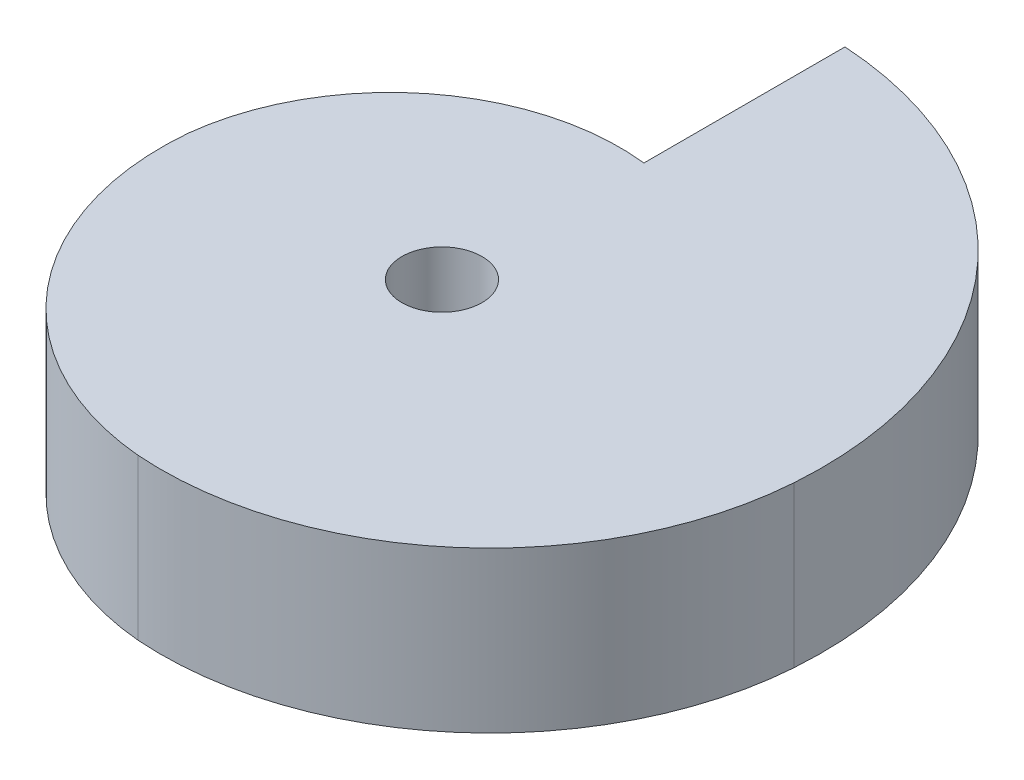
ISO-10303-21;
HEADER;
FILE_DESCRIPTION(('STEP AP214'),'2;1');
FILE_NAME('part.step','',(''),(''),'','','');
FILE_SCHEMA(('AUTOMOTIVE_DESIGN { 1 0 10303 214 1 1 1 1 }'));
ENDSEC;
DATA;
#1=APPLICATION_CONTEXT('core data for automotive mechanical design processes');
#2=APPLICATION_PROTOCOL_DEFINITION('international standard','automotive_design',2000,#1);
#3=PRODUCT_CONTEXT('',#1,'mechanical');
#4=PRODUCT('Part','Part','',(#3));
#5=PRODUCT_RELATED_PRODUCT_CATEGORY('part','',(#4));
#6=PRODUCT_DEFINITION_FORMATION('','',#4);
#7=PRODUCT_DEFINITION_CONTEXT('part definition',#1,'design');
#8=PRODUCT_DEFINITION('design','',#6,#7);
#9=PRODUCT_DEFINITION_SHAPE('','',#8);
#10=(LENGTH_UNIT() NAMED_UNIT(*) SI_UNIT(.MILLI.,.METRE.));
#11=(NAMED_UNIT(*) PLANE_ANGLE_UNIT() SI_UNIT($,.RADIAN.));
#12=(NAMED_UNIT(*) SI_UNIT($,.STERADIAN.) SOLID_ANGLE_UNIT());
#13=UNCERTAINTY_MEASURE_WITH_UNIT(LENGTH_MEASURE(1.E-05),#10,'distance_accuracy_value','');
#14=(GEOMETRIC_REPRESENTATION_CONTEXT(3) GLOBAL_UNCERTAINTY_ASSIGNED_CONTEXT((#13)) GLOBAL_UNIT_ASSIGNED_CONTEXT((#10,
#11,#12)) REPRESENTATION_CONTEXT('',''));
#15=CARTESIAN_POINT('',(0.,0.,0.));
#16=DIRECTION('',(0.,0.,1.));
#17=DIRECTION('',(1.,0.,0.));
#18=AXIS2_PLACEMENT_3D('',#15,#16,#17);
#19=CARTESIAN_POINT('',(0.758997716997192,5.08,-0.758997716997387));
#20=DIRECTION('',(0.,-1.,0.));
#21=DIRECTION('',(0.,0.,-1.));
#22=AXIS2_PLACEMENT_3D('',#19,#20,#21);
#23=CYLINDRICAL_SURFACE('',#22,10.4303428605781);
#24=CARTESIAN_POINT('',(0.758997716997192,0.,-0.758997716997387));
#25=DIRECTION('',(0.,1.,0.));
#26=DIRECTION('',(0.,0.,1.));
#27=AXIS2_PLACEMENT_3D('',#24,#25,#26);
#28=CIRCLE('',#27,10.4303428605781);
#29=CARTESIAN_POINT('',(0.,0.,9.64369302409479));
#30=VERTEX_POINT('',#29);
#31=CARTESIAN_POINT('',(11.1616884580894,0.,0.));
#32=VERTEX_POINT('',#31);
#33=EDGE_CURVE('E127',#30,#32,#28,.T.);
#34=ORIENTED_EDGE('',*,*,#33,.T.);
#35=DIRECTION('',(0.,-1.,0.));
#36=VECTOR('',#35,1.);
#37=CARTESIAN_POINT('',(11.1616884580894,5.08,0.));
#38=LINE('',#37,#36);
#39=CARTESIAN_POINT('',(11.1616884580894,5.08,0.));
#40=VERTEX_POINT('',#39);
#41=EDGE_CURVE('E11',#40,#32,#38,.T.);
#42=ORIENTED_EDGE('',*,*,#41,.F.);
#43=CARTESIAN_POINT('',(0.758997716997192,5.08,-0.758997716997387));
#44=DIRECTION('',(0.,1.,0.));
#45=DIRECTION('',(0.,0.,1.));
#46=AXIS2_PLACEMENT_3D('',#43,#44,#45);
#47=CIRCLE('',#46,10.4303428605781);
#48=CARTESIAN_POINT('',(0.,5.08,9.64369302409479));
#49=VERTEX_POINT('',#48);
#50=EDGE_CURVE('E116',#49,#40,#47,.T.);
#51=ORIENTED_EDGE('',*,*,#50,.F.);
#52=DIRECTION('',(0.,-1.,0.));
#53=VECTOR('',#52,1.);
#54=CARTESIAN_POINT('',(0.,5.08,9.64369302409479));
#55=LINE('',#54,#53);
#56=EDGE_CURVE('E122',#49,#30,#55,.T.);
#57=ORIENTED_EDGE('',*,*,#56,.T.);
#58=EDGE_LOOP('',(#34,#42,#51,#57));
#59=FACE_BOUND('',#58,.T.);
#60=ADVANCED_FACE('F41',(#59),#23,.T.);
#61=CARTESIAN_POINT('',(-0.742561583801506,5.08,-0.868553995234179));
#62=DIRECTION('',(0.,-1.,0.));
#63=DIRECTION('',(0.,0.,-1.));
#64=AXIS2_PLACEMENT_3D('',#61,#62,#63);
#65=CYLINDRICAL_SURFACE('',#64,11.9358935611246);
#66=CARTESIAN_POINT('',(-0.742561583801506,0.,-0.868553995234179));
#67=DIRECTION('',(0.,1.,0.));
#68=DIRECTION('',(0.,0.,1.));
#69=AXIS2_PLACEMENT_3D('',#66,#67,#68);
#70=CIRCLE('',#69,11.9358935611246);
#71=CARTESIAN_POINT('',(0.,0.,-12.7813268629068));
#72=VERTEX_POINT('',#71);
#73=EDGE_CURVE('E131',#32,#72,#70,.T.);
#74=ORIENTED_EDGE('',*,*,#73,.T.);
#75=DIRECTION('',(0.,-1.,0.));
#76=VECTOR('',#75,1.);
#77=CARTESIAN_POINT('',(0.,5.08,-12.7813268629068));
#78=LINE('',#77,#76);
#79=CARTESIAN_POINT('',(0.,5.08,-12.7813268629068));
#80=VERTEX_POINT('',#79);
#81=EDGE_CURVE('E51',#80,#72,#78,.T.);
#82=ORIENTED_EDGE('',*,*,#81,.F.);
#83=CARTESIAN_POINT('',(-0.742561583801506,5.08,-0.868553995234179));
#84=DIRECTION('',(0.,1.,0.));
#85=DIRECTION('',(0.,0.,1.));
#86=AXIS2_PLACEMENT_3D('',#83,#84,#85);
#87=CIRCLE('',#86,11.9358935611246);
#88=EDGE_CURVE('E92',#40,#80,#87,.T.);
#89=ORIENTED_EDGE('',*,*,#88,.F.);
#90=ORIENTED_EDGE('',*,*,#41,.T.);
#91=EDGE_LOOP('',(#74,#82,#89,#90));
#92=FACE_BOUND('',#91,.T.);
#93=ADVANCED_FACE('F146',(#92),#65,.T.);
#94=CARTESIAN_POINT('',(0.,5.08,0.));
#95=DIRECTION('',(-1.,0.,0.));
#96=DIRECTION('',(0.,0.,1.));
#97=AXIS2_PLACEMENT_3D('',#94,#95,#96);
#98=PLANE('',#97);
#99=DIRECTION('',(0.,0.,-1.));
#100=VECTOR('',#99,1.);
#101=CARTESIAN_POINT('',(0.,0.,0.));
#102=LINE('',#101,#100);
#103=CARTESIAN_POINT('',(0.,0.,-6.40537371769724));
#104=VERTEX_POINT('',#103);
#105=EDGE_CURVE('E104',#104,#72,#102,.T.);
#106=ORIENTED_EDGE('',*,*,#105,.F.);
#107=DIRECTION('',(0.,-1.,0.));
#108=VECTOR('',#107,1.);
#109=CARTESIAN_POINT('',(0.,5.08,-6.40537371769724));
#110=LINE('',#109,#108);
#111=CARTESIAN_POINT('',(0.,5.08,-6.40537371769724));
#112=VERTEX_POINT('',#111);
#113=EDGE_CURVE('E98',#112,#104,#110,.T.);
#114=ORIENTED_EDGE('',*,*,#113,.F.);
#115=DIRECTION('',(0.,0.,-1.));
#116=VECTOR('',#115,1.);
#117=CARTESIAN_POINT('',(0.,5.08,0.));
#118=LINE('',#117,#116);
#119=EDGE_CURVE('E102',#112,#80,#118,.T.);
#120=ORIENTED_EDGE('',*,*,#119,.T.);
#121=ORIENTED_EDGE('',*,*,#81,.T.);
#122=EDGE_LOOP('',(#106,#114,#120,#121));
#123=FACE_BOUND('',#122,.T.);
#124=ADVANCED_FACE('F100',(#123),#98,.T.);
#125=CARTESIAN_POINT('',(-0.818985188716092,5.08,0.81898518871609));
#126=DIRECTION('',(0.,-1.,0.));
#127=DIRECTION('',(0.,0.,-1.));
#128=AXIS2_PLACEMENT_3D('',#125,#126,#127);
#129=CYLINDRICAL_SURFACE('',#128,7.27063259613701);
#130=CARTESIAN_POINT('',(-0.818985188716092,0.,0.81898518871609));
#131=DIRECTION('',(0.,1.,0.));
#132=DIRECTION('',(0.,0.,1.));
#133=AXIS2_PLACEMENT_3D('',#130,#131,#132);
#134=CIRCLE('',#133,7.27063259613701);
#135=CARTESIAN_POINT('',(-8.04334409512943,0.,0.));
#136=VERTEX_POINT('',#135);
#137=EDGE_CURVE('E78',#104,#136,#134,.T.);
#138=ORIENTED_EDGE('',*,*,#137,.T.);
#139=DIRECTION('',(0.,-1.,0.));
#140=VECTOR('',#139,1.);
#141=CARTESIAN_POINT('',(-8.04334409512943,5.08,0.));
#142=LINE('',#141,#140);
#143=CARTESIAN_POINT('',(-8.04334409512943,5.08,0.));
#144=VERTEX_POINT('',#143);
#145=EDGE_CURVE('E106',#144,#136,#142,.T.);
#146=ORIENTED_EDGE('',*,*,#145,.F.);
#147=CARTESIAN_POINT('',(-0.818985188716092,5.08,0.81898518871609));
#148=DIRECTION('',(0.,1.,0.));
#149=DIRECTION('',(0.,0.,1.));
#150=AXIS2_PLACEMENT_3D('',#147,#148,#149);
#151=CIRCLE('',#150,7.27063259613701);
#152=EDGE_CURVE('E108',#112,#144,#151,.T.);
#153=ORIENTED_EDGE('',*,*,#152,.F.);
#154=ORIENTED_EDGE('',*,*,#113,.T.);
#155=EDGE_LOOP('',(#138,#146,#153,#154));
#156=FACE_BOUND('',#155,.T.);
#157=ADVANCED_FACE('F109',(#156),#129,.T.);
#158=CARTESIAN_POINT('',(0.,5.08,0.));
#159=DIRECTION('',(0.,-1.,0.));
#160=DIRECTION('',(0.,0.,-1.));
#161=AXIS2_PLACEMENT_3D('',#158,#159,#160);
#162=CYLINDRICAL_SURFACE('',#161,1.27);
#163=CARTESIAN_POINT('',(0.,5.08,0.));
#164=DIRECTION('',(0.,1.,0.));
#165=DIRECTION('',(0.,0.,1.));
#166=AXIS2_PLACEMENT_3D('',#163,#164,#165);
#167=CIRCLE('',#166,1.27);
#168=CARTESIAN_POINT('',(0.,5.08,1.27));
#169=VERTEX_POINT('',#168);
#170=EDGE_CURVE('E141',#169,#169,#167,.T.);
#171=ORIENTED_EDGE('',*,*,#170,.T.);
#172=EDGE_LOOP('',(#171));
#173=FACE_BOUND('',#172,.T.);
#174=CARTESIAN_POINT('',(0.,0.,0.));
#175=DIRECTION('',(0.,1.,0.));
#176=DIRECTION('',(0.,0.,1.));
#177=AXIS2_PLACEMENT_3D('',#174,#175,#176);
#178=CIRCLE('',#177,1.27);
#179=CARTESIAN_POINT('',(0.,0.,1.27));
#180=VERTEX_POINT('',#179);
#181=EDGE_CURVE('E123',#180,#180,#178,.T.);
#182=ORIENTED_EDGE('',*,*,#181,.F.);
#183=EDGE_LOOP('',(#182));
#184=FACE_BOUND('',#183,.T.);
#185=ADVANCED_FACE('F43',(#173,#184),#162,.F.);
#186=CARTESIAN_POINT('',(0.800174464482666,5.08,0.800174464482696));
#187=DIRECTION('',(0.,-1.,0.));
#188=DIRECTION('',(0.,0.,-1.));
#189=AXIS2_PLACEMENT_3D('',#186,#187,#188);
#190=CYLINDRICAL_SURFACE('',#189,8.87964524560603);
#191=CARTESIAN_POINT('',(0.800174464482666,0.,0.800174464482696));
#192=DIRECTION('',(0.,1.,0.));
#193=DIRECTION('',(0.,0.,1.));
#194=AXIS2_PLACEMENT_3D('',#191,#192,#193);
#195=CIRCLE('',#194,8.87964524560603);
#196=EDGE_CURVE('E84',#136,#30,#195,.T.);
#197=ORIENTED_EDGE('',*,*,#196,.T.);
#198=ORIENTED_EDGE('',*,*,#56,.F.);
#199=CARTESIAN_POINT('',(0.800174464482666,5.08,0.800174464482696));
#200=DIRECTION('',(0.,1.,0.));
#201=DIRECTION('',(0.,0.,1.));
#202=AXIS2_PLACEMENT_3D('',#199,#200,#201);
#203=CIRCLE('',#202,8.87964524560603);
#204=EDGE_CURVE('E59',#144,#49,#203,.T.);
#205=ORIENTED_EDGE('',*,*,#204,.F.);
#206=ORIENTED_EDGE('',*,*,#145,.T.);
#207=EDGE_LOOP('',(#197,#198,#205,#206));
#208=FACE_BOUND('',#207,.T.);
#209=ADVANCED_FACE('F153',(#208),#190,.T.);
#210=CARTESIAN_POINT('',(0.,5.08,0.));
#211=DIRECTION('',(0.,1.,0.));
#212=DIRECTION('',(0.,0.,1.));
#213=AXIS2_PLACEMENT_3D('',#210,#211,#212);
#214=PLANE('',#213);
#215=ORIENTED_EDGE('',*,*,#170,.F.);
#216=EDGE_LOOP('',(#215));
#217=FACE_BOUND('',#216,.T.);
#218=ORIENTED_EDGE('',*,*,#50,.T.);
#219=ORIENTED_EDGE('',*,*,#88,.T.);
#220=ORIENTED_EDGE('',*,*,#119,.F.);
#221=ORIENTED_EDGE('',*,*,#152,.T.);
#222=ORIENTED_EDGE('',*,*,#204,.T.);
#223=EDGE_LOOP('',(#218,#219,#220,#221,#222));
#224=FACE_BOUND('',#223,.T.);
#225=ADVANCED_FACE('F112',(#217,#224),#214,.T.);
#226=CARTESIAN_POINT('',(0.,0.,0.));
#227=DIRECTION('',(0.,1.,0.));
#228=DIRECTION('',(0.,0.,1.));
#229=AXIS2_PLACEMENT_3D('',#226,#227,#228);
#230=PLANE('',#229);
#231=ORIENTED_EDGE('',*,*,#181,.T.);
#232=EDGE_LOOP('',(#231));
#233=FACE_BOUND('',#232,.T.);
#234=ORIENTED_EDGE('',*,*,#33,.F.);
#235=ORIENTED_EDGE('',*,*,#196,.F.);
#236=ORIENTED_EDGE('',*,*,#137,.F.);
#237=ORIENTED_EDGE('',*,*,#105,.T.);
#238=ORIENTED_EDGE('',*,*,#73,.F.);
#239=EDGE_LOOP('',(#234,#235,#236,#237,#238));
#240=FACE_BOUND('',#239,.T.);
#241=ADVANCED_FACE('F150',(#233,#240),#230,.F.);
#242=CLOSED_SHELL('',(#60,#93,#124,#157,#185,#209,#225,#241));
#243=MANIFOLD_SOLID_BREP('B2',#242);
#244=ADVANCED_BREP_SHAPE_REPRESENTATION('',(#18,#243),#14);
#245=SHAPE_DEFINITION_REPRESENTATION(#9,#244);
ENDSEC;
END-ISO-10303-21;
